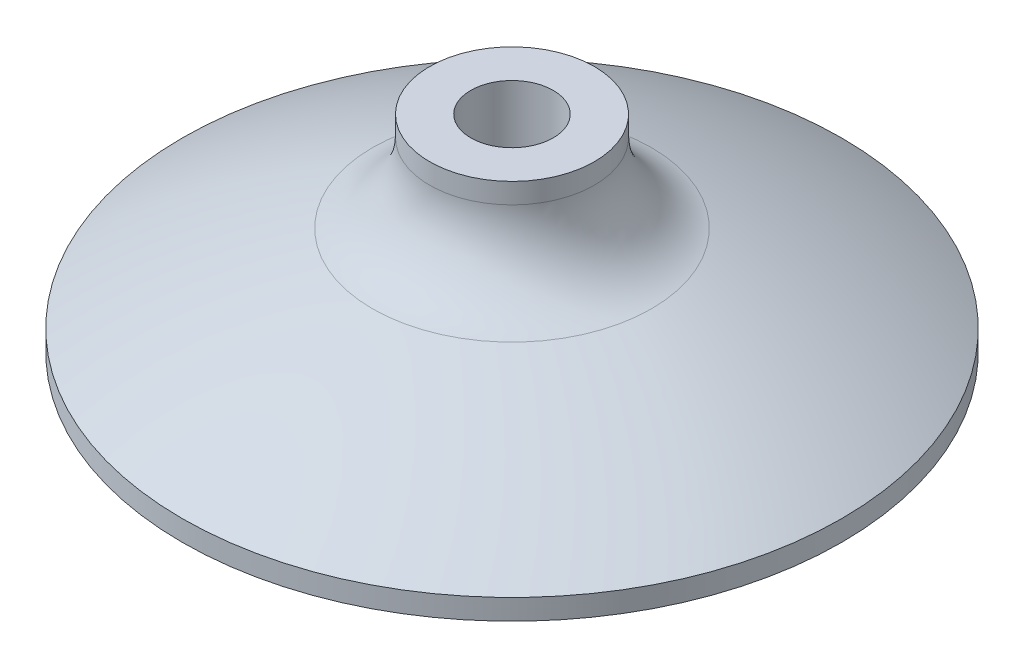
ISO-10303-21;
HEADER;
FILE_DESCRIPTION(('STEP AP214'),'2;1');
FILE_NAME('part.step','',(''),(''),'','','');
FILE_SCHEMA(('AUTOMOTIVE_DESIGN { 1 0 10303 214 1 1 1 1 }'));
ENDSEC;
DATA;
#1=APPLICATION_CONTEXT('core data for automotive mechanical design processes');
#2=APPLICATION_PROTOCOL_DEFINITION('international standard','automotive_design',2000,#1);
#3=PRODUCT_CONTEXT('',#1,'mechanical');
#4=PRODUCT('Part','Part','',(#3));
#5=PRODUCT_RELATED_PRODUCT_CATEGORY('part','',(#4));
#6=PRODUCT_DEFINITION_FORMATION('','',#4);
#7=PRODUCT_DEFINITION_CONTEXT('part definition',#1,'design');
#8=PRODUCT_DEFINITION('design','',#6,#7);
#9=PRODUCT_DEFINITION_SHAPE('','',#8);
#10=(LENGTH_UNIT() NAMED_UNIT(*) SI_UNIT(.MILLI.,.METRE.));
#11=(NAMED_UNIT(*) PLANE_ANGLE_UNIT() SI_UNIT($,.RADIAN.));
#12=(NAMED_UNIT(*) SI_UNIT($,.STERADIAN.) SOLID_ANGLE_UNIT());
#13=UNCERTAINTY_MEASURE_WITH_UNIT(LENGTH_MEASURE(1.E-05),#10,'distance_accuracy_value','');
#14=(GEOMETRIC_REPRESENTATION_CONTEXT(3) GLOBAL_UNCERTAINTY_ASSIGNED_CONTEXT((#13)) GLOBAL_UNIT_ASSIGNED_CONTEXT((#10,
#11,#12)) REPRESENTATION_CONTEXT('',''));
#15=CARTESIAN_POINT('',(0.,0.,0.));
#16=DIRECTION('',(0.,0.,1.));
#17=DIRECTION('',(1.,0.,0.));
#18=AXIS2_PLACEMENT_3D('',#15,#16,#17);
#19=CARTESIAN_POINT('',(0.,0.,-6.35));
#20=DIRECTION('',(0.,1.,0.));
#21=DIRECTION('',(0.,0.,1.));
#22=AXIS2_PLACEMENT_3D('',#19,#20,#21);
#23=PLANE('',#22);
#24=CARTESIAN_POINT('',(0.,0.,0.));
#25=DIRECTION('',(0.,-1.,0.));
#26=DIRECTION('',(0.,0.,-1.));
#27=AXIS2_PLACEMENT_3D('',#24,#25,#26);
#28=CIRCLE('',#27,6.35);
#29=CARTESIAN_POINT('',(0.,0.,-6.35));
#30=VERTEX_POINT('',#29);
#31=EDGE_CURVE('E390',#30,#30,#28,.T.);
#32=ORIENTED_EDGE('',*,*,#31,.F.);
#33=EDGE_LOOP('',(#32));
#34=FACE_BOUND('',#33,.T.);
#35=CARTESIAN_POINT('',(0.,0.,0.));
#36=DIRECTION('',(0.,-1.,0.));
#37=DIRECTION('',(0.,0.,-1.));
#38=AXIS2_PLACEMENT_3D('',#35,#36,#37);
#39=CIRCLE('',#38,25.4);
#40=CARTESIAN_POINT('',(0.,0.,-25.4));
#41=VERTEX_POINT('',#40);
#42=EDGE_CURVE('E369',#41,#41,#39,.T.);
#43=ORIENTED_EDGE('',*,*,#42,.T.);
#44=EDGE_LOOP('',(#43));
#45=FACE_BOUND('',#44,.T.);
#46=ADVANCED_FACE('F359',(#34,#45),#23,.F.);
#47=CARTESIAN_POINT('',(0.,-3.48645342387999,0.));
#48=DIRECTION('',(0.,-1.,0.));
#49=DIRECTION('',(0.,0.,-1.));
#50=AXIS2_PLACEMENT_3D('',#47,#48,#49);
#51=CYLINDRICAL_SURFACE('',#50,25.4);
#52=ORIENTED_EDGE('',*,*,#42,.F.);
#53=EDGE_LOOP('',(#52));
#54=FACE_BOUND('',#53,.T.);
#55=CARTESIAN_POINT('',(0.,1.58749999999999,0.));
#56=DIRECTION('',(0.,-1.,0.));
#57=DIRECTION('',(0.,0.,-1.));
#58=AXIS2_PLACEMENT_3D('',#55,#56,#57);
#59=CIRCLE('',#58,25.4);
#60=CARTESIAN_POINT('',(0.,1.5875,-25.4));
#61=VERTEX_POINT('',#60);
#62=EDGE_CURVE('E373',#61,#61,#59,.T.);
#63=ORIENTED_EDGE('',*,*,#62,.T.);
#64=EDGE_LOOP('',(#63));
#65=FACE_BOUND('',#64,.T.);
#66=ADVANCED_FACE('F398',(#54,#65),#51,.T.);
#67=CARTESIAN_POINT('',(0.,-58.2132410162176,0.));
#68=DIRECTION('',(0.,-1.,0.));
#69=DIRECTION('',(0.,0.,-1.));
#70=AXIS2_PLACEMENT_3D('',#67,#68,#69);
#71=DEGENERATE_TOROIDAL_SURFACE('',#70,10.6956212567574,69.85,.F.);
#72=CARTESIAN_POINT('',(0.,8.26301172088427,0.));
#73=DIRECTION('',(0.,-1.,0.));
#74=DIRECTION('',(0.,0.,-1.));
#75=AXIS2_PLACEMENT_3D('',#72,#73,#74);
#76=CIRCLE('',#75,10.7503648952702);
#77=CARTESIAN_POINT('',(0.,8.26301172088427,-10.7503648952702));
#78=VERTEX_POINT('',#77);
#79=EDGE_CURVE('E365',#78,#78,#76,.T.);
#80=ORIENTED_EDGE('',*,*,#79,.T.);
#81=EDGE_LOOP('',(#80));
#82=FACE_BOUND('',#81,.T.);
#83=ORIENTED_EDGE('',*,*,#62,.F.);
#84=EDGE_LOOP('',(#83));
#85=FACE_BOUND('',#84,.T.);
#86=ADVANCED_FACE('F403',(#82,#85),#71,.F.);
#87=CARTESIAN_POINT('',(0.,-3.48645342387999,0.));
#88=DIRECTION('',(0.,-1.,0.));
#89=DIRECTION('',(0.,0.,-1.));
#90=AXIS2_PLACEMENT_3D('',#87,#88,#89);
#91=CYLINDRICAL_SURFACE('',#90,6.35);
#92=CARTESIAN_POINT('',(0.,14.3063074242572,0.));
#93=DIRECTION('',(0.,-1.,0.));
#94=DIRECTION('',(0.,0.,-1.));
#95=AXIS2_PLACEMENT_3D('',#92,#93,#94);
#96=CIRCLE('',#95,6.35);
#97=CARTESIAN_POINT('',(0.,14.3063074242572,-6.35));
#98=VERTEX_POINT('',#97);
#99=EDGE_CURVE('E11',#98,#98,#96,.F.);
#100=ORIENTED_EDGE('',*,*,#99,.T.);
#101=EDGE_LOOP('',(#100));
#102=FACE_BOUND('',#101,.T.);
#103=CARTESIAN_POINT('',(0.,15.875,0.));
#104=DIRECTION('',(0.,-1.,0.));
#105=DIRECTION('',(0.,0.,-1.));
#106=AXIS2_PLACEMENT_3D('',#103,#104,#105);
#107=CIRCLE('',#106,6.35);
#108=CARTESIAN_POINT('',(0.,15.875,-6.35));
#109=VERTEX_POINT('',#108);
#110=EDGE_CURVE('E378',#109,#109,#107,.T.);
#111=ORIENTED_EDGE('',*,*,#110,.T.);
#112=EDGE_LOOP('',(#111));
#113=FACE_BOUND('',#112,.T.);
#114=ADVANCED_FACE('F407',(#102,#113),#91,.T.);
#115=CARTESIAN_POINT('',(0.,15.875,-6.35));
#116=DIRECTION('',(0.,-1.,0.));
#117=DIRECTION('',(0.,0.,-1.));
#118=AXIS2_PLACEMENT_3D('',#115,#116,#117);
#119=PLANE('',#118);
#120=ORIENTED_EDGE('',*,*,#110,.F.);
#121=EDGE_LOOP('',(#120));
#122=FACE_BOUND('',#121,.T.);
#123=CARTESIAN_POINT('',(0.,15.875,0.));
#124=DIRECTION('',(0.,-1.,0.));
#125=DIRECTION('',(0.,0.,-1.));
#126=AXIS2_PLACEMENT_3D('',#123,#124,#125);
#127=CIRCLE('',#126,3.175);
#128=CARTESIAN_POINT('',(0.,15.875,-3.175));
#129=VERTEX_POINT('',#128);
#130=EDGE_CURVE('E381',#129,#129,#127,.T.);
#131=ORIENTED_EDGE('',*,*,#130,.T.);
#132=EDGE_LOOP('',(#131));
#133=FACE_BOUND('',#132,.T.);
#134=ADVANCED_FACE('F413',(#122,#133),#119,.F.);
#135=CARTESIAN_POINT('',(0.,-3.48645342387999,0.));
#136=DIRECTION('',(0.,-1.,0.));
#137=DIRECTION('',(0.,0.,-1.));
#138=AXIS2_PLACEMENT_3D('',#135,#136,#137);
#139=CYLINDRICAL_SURFACE('',#138,3.175);
#140=ORIENTED_EDGE('',*,*,#130,.F.);
#141=EDGE_LOOP('',(#140));
#142=FACE_BOUND('',#141,.T.);
#143=CARTESIAN_POINT('',(0.,6.604,0.));
#144=DIRECTION('',(0.,-1.,0.));
#145=DIRECTION('',(0.,0.,-1.));
#146=AXIS2_PLACEMENT_3D('',#143,#144,#145);
#147=CIRCLE('',#146,3.175);
#148=CARTESIAN_POINT('',(0.,6.604,-3.175));
#149=VERTEX_POINT('',#148);
#150=EDGE_CURVE('E384',#149,#149,#147,.T.);
#151=ORIENTED_EDGE('',*,*,#150,.T.);
#152=EDGE_LOOP('',(#151));
#153=FACE_BOUND('',#152,.T.);
#154=ADVANCED_FACE('F418',(#142,#153),#139,.F.);
#155=CARTESIAN_POINT('',(0.,6.604,-3.175));
#156=DIRECTION('',(0.,1.,0.));
#157=DIRECTION('',(0.,0.,1.));
#158=AXIS2_PLACEMENT_3D('',#155,#156,#157);
#159=PLANE('',#158);
#160=ORIENTED_EDGE('',*,*,#150,.F.);
#161=EDGE_LOOP('',(#160));
#162=FACE_BOUND('',#161,.T.);
#163=CARTESIAN_POINT('',(0.,6.604,0.));
#164=DIRECTION('',(0.,-1.,0.));
#165=DIRECTION('',(0.,0.,-1.));
#166=AXIS2_PLACEMENT_3D('',#163,#164,#165);
#167=CIRCLE('',#166,6.35);
#168=CARTESIAN_POINT('',(0.,6.604,-6.35));
#169=VERTEX_POINT('',#168);
#170=EDGE_CURVE('E387',#169,#169,#167,.T.);
#171=ORIENTED_EDGE('',*,*,#170,.T.);
#172=EDGE_LOOP('',(#171));
#173=FACE_BOUND('',#172,.T.);
#174=ADVANCED_FACE('F422',(#162,#173),#159,.F.);
#175=CARTESIAN_POINT('',(0.,-3.48645342387999,0.));
#176=DIRECTION('',(0.,-1.,0.));
#177=DIRECTION('',(0.,0.,-1.));
#178=AXIS2_PLACEMENT_3D('',#175,#176,#177);
#179=CYLINDRICAL_SURFACE('',#178,6.35);
#180=ORIENTED_EDGE('',*,*,#170,.F.);
#181=EDGE_LOOP('',(#180));
#182=FACE_BOUND('',#181,.T.);
#183=ORIENTED_EDGE('',*,*,#31,.T.);
#184=EDGE_LOOP('',(#183));
#185=FACE_BOUND('',#184,.T.);
#186=ADVANCED_FACE('F394',(#182,#185),#179,.F.);
#187=CARTESIAN_POINT('',(0.,14.3063074242572,0.));
#188=DIRECTION('',(0.,-1.,0.));
#189=DIRECTION('',(0.,0.,-1.));
#190=AXIS2_PLACEMENT_3D('',#187,#188,#189);
#191=TOROIDAL_SURFACE('',#190,12.7,6.35);
#192=ORIENTED_EDGE('',*,*,#99,.F.);
#193=EDGE_LOOP('',(#192));
#194=FACE_BOUND('',#193,.T.);
#195=ORIENTED_EDGE('',*,*,#79,.F.);
#196=EDGE_LOOP('',(#195));
#197=FACE_BOUND('',#196,.T.);
#198=ADVANCED_FACE('F428',(#194,#197),#191,.F.);
#199=CLOSED_SHELL('',(#46,#66,#86,#114,#134,#154,#174,#186,#198));
#200=MANIFOLD_SOLID_BREP('B2',#199);
#201=ADVANCED_BREP_SHAPE_REPRESENTATION('',(#18,#200),#14);
#202=SHAPE_DEFINITION_REPRESENTATION(#9,#201);
ENDSEC;
END-ISO-10303-21;
